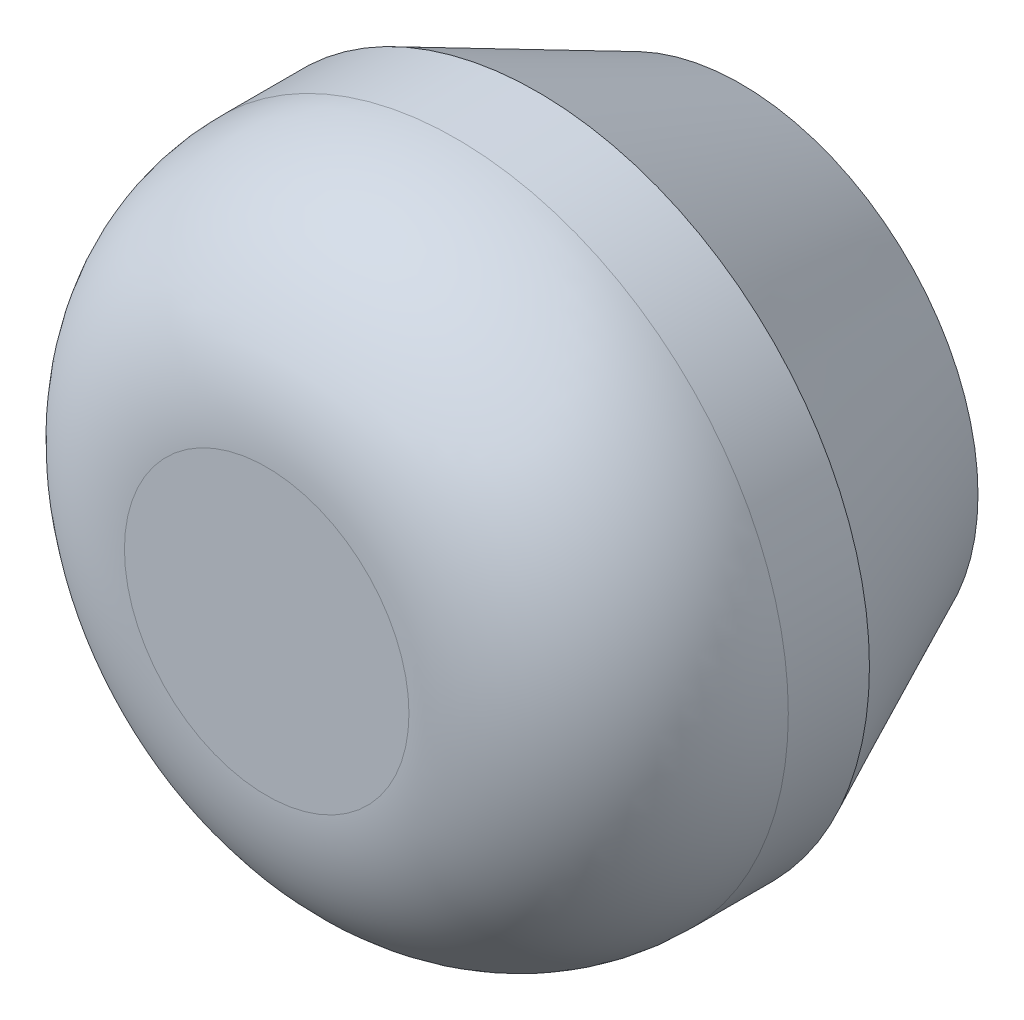
ISO-10303-21;
HEADER;
FILE_DESCRIPTION(('STEP AP214'),'2;1');
FILE_NAME('part.step','',(''),(''),'','','');
FILE_SCHEMA(('AUTOMOTIVE_DESIGN { 1 0 10303 214 1 1 1 1 }'));
ENDSEC;
DATA;
#1=APPLICATION_CONTEXT('core data for automotive mechanical design processes');
#2=APPLICATION_PROTOCOL_DEFINITION('international standard','automotive_design',2000,#1);
#3=PRODUCT_CONTEXT('',#1,'mechanical');
#4=PRODUCT('Part','Part','',(#3));
#5=PRODUCT_RELATED_PRODUCT_CATEGORY('part','',(#4));
#6=PRODUCT_DEFINITION_FORMATION('','',#4);
#7=PRODUCT_DEFINITION_CONTEXT('part definition',#1,'design');
#8=PRODUCT_DEFINITION('design','',#6,#7);
#9=PRODUCT_DEFINITION_SHAPE('','',#8);
#10=(LENGTH_UNIT() NAMED_UNIT(*) SI_UNIT(.MILLI.,.METRE.));
#11=(NAMED_UNIT(*) PLANE_ANGLE_UNIT() SI_UNIT($,.RADIAN.));
#12=(NAMED_UNIT(*) SI_UNIT($,.STERADIAN.) SOLID_ANGLE_UNIT());
#13=UNCERTAINTY_MEASURE_WITH_UNIT(LENGTH_MEASURE(1.E-05),#10,'distance_accuracy_value','');
#14=(GEOMETRIC_REPRESENTATION_CONTEXT(3) GLOBAL_UNCERTAINTY_ASSIGNED_CONTEXT((#13)) GLOBAL_UNIT_ASSIGNED_CONTEXT((#10,
#11,#12)) REPRESENTATION_CONTEXT('',''));
#15=CARTESIAN_POINT('',(0.,0.,0.));
#16=DIRECTION('',(0.,0.,1.));
#17=DIRECTION('',(1.,0.,0.));
#18=AXIS2_PLACEMENT_3D('',#15,#16,#17);
#19=CARTESIAN_POINT('',(0.,0.,5.));
#20=DIRECTION('',(0.,0.,-1.));
#21=DIRECTION('',(-1.,0.,0.));
#22=AXIS2_PLACEMENT_3D('',#19,#20,#21);
#23=CYLINDRICAL_SURFACE('',#22,3.5);
#24=CARTESIAN_POINT('',(0.,0.,2.14450692050956));
#25=DIRECTION('',(0.,0.,1.));
#26=DIRECTION('',(1.,0.,0.));
#27=AXIS2_PLACEMENT_3D('',#24,#25,#26);
#28=CIRCLE('',#27,3.5);
#29=CARTESIAN_POINT('',(3.5,0.,2.14450692050956));
#30=VERTEX_POINT('',#29);
#31=EDGE_CURVE('E44',#30,#30,#28,.T.);
#32=ORIENTED_EDGE('',*,*,#31,.T.);
#33=EDGE_LOOP('',(#32));
#34=FACE_BOUND('',#33,.T.);
#35=CARTESIAN_POINT('',(0.,0.,3.));
#36=DIRECTION('',(0.,0.,1.));
#37=DIRECTION('',(1.,0.,0.));
#38=AXIS2_PLACEMENT_3D('',#35,#36,#37);
#39=CIRCLE('',#38,3.5);
#40=CARTESIAN_POINT('',(3.5,0.,3.));
#41=VERTEX_POINT('',#40);
#42=EDGE_CURVE('E117',#41,#41,#39,.F.);
#43=ORIENTED_EDGE('',*,*,#42,.T.);
#44=EDGE_LOOP('',(#43));
#45=FACE_BOUND('',#44,.T.);
#46=ADVANCED_FACE('F35',(#34,#45),#23,.T.);
#47=CARTESIAN_POINT('',(0.,0.,5.));
#48=DIRECTION('',(0.,0.,1.));
#49=DIRECTION('',(1.,0.,0.));
#50=AXIS2_PLACEMENT_3D('',#47,#48,#49);
#51=PLANE('',#50);
#52=CARTESIAN_POINT('',(0.,0.,5.));
#53=DIRECTION('',(0.,0.,1.));
#54=DIRECTION('',(1.,0.,0.));
#55=AXIS2_PLACEMENT_3D('',#52,#53,#54);
#56=CIRCLE('',#55,1.5);
#57=CARTESIAN_POINT('',(1.5,0.,5.));
#58=VERTEX_POINT('',#57);
#59=EDGE_CURVE('E112',#58,#58,#56,.T.);
#60=ORIENTED_EDGE('',*,*,#59,.T.);
#61=EDGE_LOOP('',(#60));
#62=FACE_BOUND('',#61,.T.);
#63=ADVANCED_FACE('F132',(#62),#51,.T.);
#64=CARTESIAN_POINT('',(0.,0.,0.));
#65=DIRECTION('',(0.,0.,1.));
#66=DIRECTION('',(1.,0.,0.));
#67=AXIS2_PLACEMENT_3D('',#64,#65,#66);
#68=PLANE('',#67);
#69=CARTESIAN_POINT('',(0.,0.,0.));
#70=DIRECTION('',(0.,0.,1.));
#71=DIRECTION('',(1.,0.,0.));
#72=AXIS2_PLACEMENT_3D('',#69,#70,#71);
#73=CIRCLE('',#72,2.5);
#74=CARTESIAN_POINT('',(2.5,0.,0.));
#75=VERTEX_POINT('',#74);
#76=EDGE_CURVE('E11',#75,#75,#73,.F.);
#77=ORIENTED_EDGE('',*,*,#76,.T.);
#78=EDGE_LOOP('',(#77));
#79=FACE_BOUND('',#78,.T.);
#80=DIRECTION('',(1.,0.,0.));
#81=VECTOR('',#80,1.);
#82=CARTESIAN_POINT('',(1.3,1.3,0.));
#83=LINE('',#82,#81);
#84=CARTESIAN_POINT('',(-1.3,1.3,0.));
#85=VERTEX_POINT('',#84);
#86=CARTESIAN_POINT('',(1.3,1.3,0.));
#87=VERTEX_POINT('',#86);
#88=EDGE_CURVE('E86',#85,#87,#83,.T.);
#89=ORIENTED_EDGE('',*,*,#88,.F.);
#90=DIRECTION('',(0.,1.,0.));
#91=VECTOR('',#90,1.);
#92=CARTESIAN_POINT('',(-1.3,1.3,0.));
#93=LINE('',#92,#91);
#94=CARTESIAN_POINT('',(-1.3,-1.3,0.));
#95=VERTEX_POINT('',#94);
#96=EDGE_CURVE('E51',#95,#85,#93,.T.);
#97=ORIENTED_EDGE('',*,*,#96,.F.);
#98=DIRECTION('',(-1.,0.,0.));
#99=VECTOR('',#98,1.);
#100=CARTESIAN_POINT('',(1.3,-1.3,0.));
#101=LINE('',#100,#99);
#102=CARTESIAN_POINT('',(1.3,-1.3,0.));
#103=VERTEX_POINT('',#102);
#104=EDGE_CURVE('E102',#103,#95,#101,.T.);
#105=ORIENTED_EDGE('',*,*,#104,.F.);
#106=DIRECTION('',(0.,-1.,0.));
#107=VECTOR('',#106,1.);
#108=CARTESIAN_POINT('',(1.3,1.3,0.));
#109=LINE('',#108,#107);
#110=EDGE_CURVE('E108',#87,#103,#109,.T.);
#111=ORIENTED_EDGE('',*,*,#110,.F.);
#112=EDGE_LOOP('',(#89,#97,#105,#111));
#113=FACE_BOUND('',#112,.T.);
#114=ADVANCED_FACE('F137',(#79,#113),#68,.F.);
#115=CARTESIAN_POINT('',(0.,0.,3.));
#116=DIRECTION('',(0.,0.,1.));
#117=DIRECTION('',(1.,0.,0.));
#118=AXIS2_PLACEMENT_3D('',#115,#116,#117);
#119=DEGENERATE_TOROIDAL_SURFACE('',#118,1.5,2.,.T.);
#120=ORIENTED_EDGE('',*,*,#42,.F.);
#121=EDGE_LOOP('',(#120));
#122=FACE_BOUND('',#121,.T.);
#123=ORIENTED_EDGE('',*,*,#59,.F.);
#124=EDGE_LOOP('',(#123));
#125=FACE_BOUND('',#124,.T.);
#126=ADVANCED_FACE('F141',(#122,#125),#119,.T.);
#127=CARTESIAN_POINT('',(-1.3,1.3,4.));
#128=DIRECTION('',(-1.,0.,0.));
#129=DIRECTION('',(0.,-1.,0.));
#130=AXIS2_PLACEMENT_3D('',#127,#128,#129);
#131=PLANE('',#130);
#132=ORIENTED_EDGE('',*,*,#96,.T.);
#133=DIRECTION('',(0.,0.,-1.));
#134=VECTOR('',#133,1.);
#135=CARTESIAN_POINT('',(-1.3,1.3,4.));
#136=LINE('',#135,#134);
#137=CARTESIAN_POINT('',(-1.3,1.3,4.));
#138=VERTEX_POINT('',#137);
#139=EDGE_CURVE('E74',#138,#85,#136,.T.);
#140=ORIENTED_EDGE('',*,*,#139,.F.);
#141=DIRECTION('',(0.,1.,0.));
#142=VECTOR('',#141,1.);
#143=CARTESIAN_POINT('',(-1.3,1.3,4.));
#144=LINE('',#143,#142);
#145=CARTESIAN_POINT('',(-1.3,-1.3,4.));
#146=VERTEX_POINT('',#145);
#147=EDGE_CURVE('E100',#146,#138,#144,.T.);
#148=ORIENTED_EDGE('',*,*,#147,.F.);
#149=DIRECTION('',(0.,0.,-1.));
#150=VECTOR('',#149,1.);
#151=CARTESIAN_POINT('',(-1.3,-1.3,4.));
#152=LINE('',#151,#150);
#153=EDGE_CURVE('E59',#146,#95,#152,.T.);
#154=ORIENTED_EDGE('',*,*,#153,.T.);
#155=EDGE_LOOP('',(#132,#140,#148,#154));
#156=FACE_BOUND('',#155,.T.);
#157=ADVANCED_FACE('F143',(#156),#131,.F.);
#158=CARTESIAN_POINT('',(1.3,-1.3,4.));
#159=DIRECTION('',(0.,-1.,0.));
#160=DIRECTION('',(0.,0.,-1.));
#161=AXIS2_PLACEMENT_3D('',#158,#159,#160);
#162=PLANE('',#161);
#163=ORIENTED_EDGE('',*,*,#104,.T.);
#164=ORIENTED_EDGE('',*,*,#153,.F.);
#165=DIRECTION('',(-1.,0.,0.));
#166=VECTOR('',#165,1.);
#167=CARTESIAN_POINT('',(1.3,-1.3,4.));
#168=LINE('',#167,#166);
#169=CARTESIAN_POINT('',(1.3,-1.3,4.));
#170=VERTEX_POINT('',#169);
#171=EDGE_CURVE('E97',#170,#146,#168,.T.);
#172=ORIENTED_EDGE('',*,*,#171,.F.);
#173=DIRECTION('',(0.,0.,-1.));
#174=VECTOR('',#173,1.);
#175=CARTESIAN_POINT('',(1.3,-1.3,4.));
#176=LINE('',#175,#174);
#177=EDGE_CURVE('E90',#170,#103,#176,.T.);
#178=ORIENTED_EDGE('',*,*,#177,.T.);
#179=EDGE_LOOP('',(#163,#164,#172,#178));
#180=FACE_BOUND('',#179,.T.);
#181=ADVANCED_FACE('F149',(#180),#162,.F.);
#182=CARTESIAN_POINT('',(1.3,1.3,4.));
#183=DIRECTION('',(1.,0.,0.));
#184=DIRECTION('',(0.,1.,0.));
#185=AXIS2_PLACEMENT_3D('',#182,#183,#184);
#186=PLANE('',#185);
#187=ORIENTED_EDGE('',*,*,#110,.T.);
#188=ORIENTED_EDGE('',*,*,#177,.F.);
#189=DIRECTION('',(0.,-1.,0.));
#190=VECTOR('',#189,1.);
#191=CARTESIAN_POINT('',(1.3,1.3,4.));
#192=LINE('',#191,#190);
#193=CARTESIAN_POINT('',(1.3,1.3,4.));
#194=VERTEX_POINT('',#193);
#195=EDGE_CURVE('E93',#194,#170,#192,.T.);
#196=ORIENTED_EDGE('',*,*,#195,.F.);
#197=DIRECTION('',(0.,0.,-1.));
#198=VECTOR('',#197,1.);
#199=CARTESIAN_POINT('',(1.3,1.3,4.));
#200=LINE('',#199,#198);
#201=EDGE_CURVE('E79',#194,#87,#200,.T.);
#202=ORIENTED_EDGE('',*,*,#201,.T.);
#203=EDGE_LOOP('',(#187,#188,#196,#202));
#204=FACE_BOUND('',#203,.T.);
#205=ADVANCED_FACE('F94',(#204),#186,.F.);
#206=CARTESIAN_POINT('',(1.3,1.3,4.));
#207=DIRECTION('',(0.,1.,0.));
#208=DIRECTION('',(0.,0.,1.));
#209=AXIS2_PLACEMENT_3D('',#206,#207,#208);
#210=PLANE('',#209);
#211=ORIENTED_EDGE('',*,*,#88,.T.);
#212=ORIENTED_EDGE('',*,*,#201,.F.);
#213=DIRECTION('',(1.,0.,0.));
#214=VECTOR('',#213,1.);
#215=CARTESIAN_POINT('',(1.3,1.3,4.));
#216=LINE('',#215,#214);
#217=EDGE_CURVE('E83',#138,#194,#216,.T.);
#218=ORIENTED_EDGE('',*,*,#217,.F.);
#219=ORIENTED_EDGE('',*,*,#139,.T.);
#220=EDGE_LOOP('',(#211,#212,#218,#219));
#221=FACE_BOUND('',#220,.T.);
#222=ADVANCED_FACE('F81',(#221),#210,.F.);
#223=CARTESIAN_POINT('',(0.,0.,4.));
#224=DIRECTION('',(0.,0.,-1.));
#225=DIRECTION('',(-1.,0.,0.));
#226=AXIS2_PLACEMENT_3D('',#223,#224,#225);
#227=PLANE('',#226);
#228=ORIENTED_EDGE('',*,*,#147,.T.);
#229=ORIENTED_EDGE('',*,*,#217,.T.);
#230=ORIENTED_EDGE('',*,*,#195,.T.);
#231=ORIENTED_EDGE('',*,*,#171,.T.);
#232=EDGE_LOOP('',(#228,#229,#230,#231));
#233=FACE_BOUND('',#232,.T.);
#234=ADVANCED_FACE('F99',(#233),#227,.T.);
#235=CARTESIAN_POINT('',(0.,0.,2.14450692050956));
#236=DIRECTION('',(0.,0.,1.));
#237=DIRECTION('',(1.,0.,0.));
#238=AXIS2_PLACEMENT_3D('',#235,#236,#237);
#239=CONICAL_SURFACE('',#238,3.5,0.436332312998584);
#240=ORIENTED_EDGE('',*,*,#76,.F.);
#241=EDGE_LOOP('',(#240));
#242=FACE_BOUND('',#241,.T.);
#243=ORIENTED_EDGE('',*,*,#31,.F.);
#244=EDGE_LOOP('',(#243));
#245=FACE_BOUND('',#244,.T.);
#246=ADVANCED_FACE('F38',(#242,#245),#239,.T.);
#247=CLOSED_SHELL('',(#46,#63,#114,#126,#157,#181,#205,#222,#234,#246));
#248=MANIFOLD_SOLID_BREP('B2',#247);
#249=ADVANCED_BREP_SHAPE_REPRESENTATION('',(#18,#248),#14);
#250=SHAPE_DEFINITION_REPRESENTATION(#9,#249);
ENDSEC;
END-ISO-10303-21;
